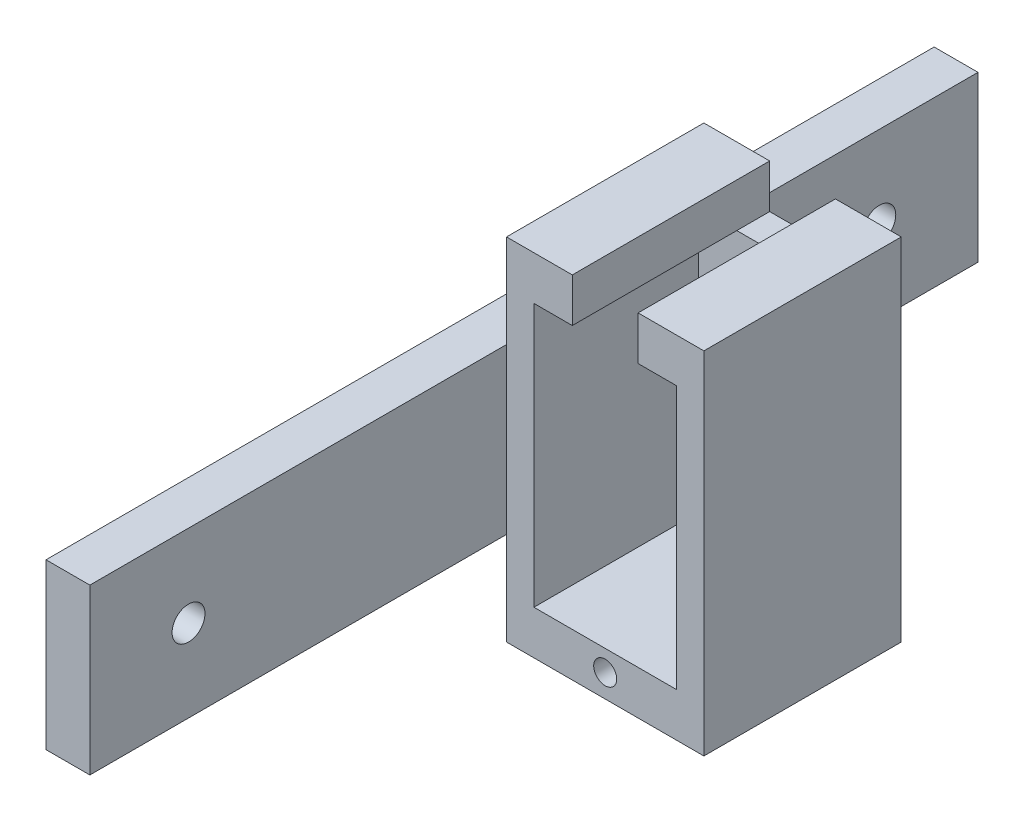
ISO-10303-21;
HEADER;
FILE_DESCRIPTION(('STEP AP214'),'2;1');
FILE_NAME('part.step','',(''),(''),'','','');
FILE_SCHEMA(('AUTOMOTIVE_DESIGN { 1 0 10303 214 1 1 1 1 }'));
ENDSEC;
DATA;
#1=APPLICATION_CONTEXT('core data for automotive mechanical design processes');
#2=APPLICATION_PROTOCOL_DEFINITION('international standard','automotive_design',2000,#1);
#3=PRODUCT_CONTEXT('',#1,'mechanical');
#4=PRODUCT('Part','Part','',(#3));
#5=PRODUCT_RELATED_PRODUCT_CATEGORY('part','',(#4));
#6=PRODUCT_DEFINITION_FORMATION('','',#4);
#7=PRODUCT_DEFINITION_CONTEXT('part definition',#1,'design');
#8=PRODUCT_DEFINITION('design','',#6,#7);
#9=PRODUCT_DEFINITION_SHAPE('','',#8);
#10=(LENGTH_UNIT() NAMED_UNIT(*) SI_UNIT(.MILLI.,.METRE.));
#11=(NAMED_UNIT(*) PLANE_ANGLE_UNIT() SI_UNIT($,.RADIAN.));
#12=(NAMED_UNIT(*) SI_UNIT($,.STERADIAN.) SOLID_ANGLE_UNIT());
#13=UNCERTAINTY_MEASURE_WITH_UNIT(LENGTH_MEASURE(1.E-05),#10,'distance_accuracy_value','');
#14=(GEOMETRIC_REPRESENTATION_CONTEXT(3) GLOBAL_UNCERTAINTY_ASSIGNED_CONTEXT((#13)) GLOBAL_UNIT_ASSIGNED_CONTEXT((#10,
#11,#12)) REPRESENTATION_CONTEXT('',''));
#15=CARTESIAN_POINT('',(0.,0.,0.));
#16=DIRECTION('',(0.,0.,1.));
#17=DIRECTION('',(1.,0.,0.));
#18=AXIS2_PLACEMENT_3D('',#15,#16,#17);
#19=CARTESIAN_POINT('',(-18.,0.,3.));
#20=DIRECTION('',(1.,0.,0.));
#21=DIRECTION('',(0.,1.,0.));
#22=AXIS2_PLACEMENT_3D('',#19,#20,#21);
#23=PLANE('',#22);
#24=DIRECTION('',(0.,0.,-1.));
#25=VECTOR('',#24,1.);
#26=CARTESIAN_POINT('',(-18.,23.5,-25.));
#27=LINE('',#26,#25);
#28=CARTESIAN_POINT('',(-18.,23.5,18.));
#29=VERTEX_POINT('',#28);
#30=CARTESIAN_POINT('',(-18.,23.5,0.));
#31=VERTEX_POINT('',#30);
#32=EDGE_CURVE('E11',#29,#31,#27,.T.);
#33=ORIENTED_EDGE('',*,*,#32,.F.);
#34=DIRECTION('',(0.,-1.,0.));
#35=VECTOR('',#34,1.);
#36=CARTESIAN_POINT('',(-18.,0.,18.));
#37=LINE('',#36,#35);
#38=CARTESIAN_POINT('',(-18.,32.,18.));
#39=VERTEX_POINT('',#38);
#40=EDGE_CURVE('E222',#39,#29,#37,.T.);
#41=ORIENTED_EDGE('',*,*,#40,.F.);
#42=DIRECTION('',(0.,0.,-1.));
#43=VECTOR('',#42,1.);
#44=CARTESIAN_POINT('',(-18.,32.,3.));
#45=LINE('',#44,#43);
#46=CARTESIAN_POINT('',(-18.,32.,0.));
#47=VERTEX_POINT('',#46);
#48=EDGE_CURVE('E307',#39,#47,#45,.T.);
#49=ORIENTED_EDGE('',*,*,#48,.T.);
#50=DIRECTION('',(0.,-1.,0.));
#51=VECTOR('',#50,1.);
#52=CARTESIAN_POINT('',(-18.,0.,0.));
#53=LINE('',#52,#51);
#54=EDGE_CURVE('E298',#47,#31,#53,.T.);
#55=ORIENTED_EDGE('',*,*,#54,.T.);
#56=EDGE_LOOP('',(#33,#41,#49,#55));
#57=FACE_BOUND('',#56,.T.);
#58=ADVANCED_FACE('F45',(#57),#23,.F.);
#59=DIRECTION('',(0.,0.,1.));
#60=VECTOR('',#59,1.);
#61=CARTESIAN_POINT('',(-18.,8.5,-25.));
#62=LINE('',#61,#60);
#63=CARTESIAN_POINT('',(-18.,8.5,0.));
#64=VERTEX_POINT('',#63);
#65=CARTESIAN_POINT('',(-18.,8.5,18.));
#66=VERTEX_POINT('',#65);
#67=EDGE_CURVE('E54',#64,#66,#62,.T.);
#68=ORIENTED_EDGE('',*,*,#67,.F.);
#69=CARTESIAN_POINT('',(-18.,0.,0.));
#70=VERTEX_POINT('',#69);
#71=EDGE_CURVE('E297',#64,#70,#53,.T.);
#72=ORIENTED_EDGE('',*,*,#71,.T.);
#73=DIRECTION('',(0.,0.,-1.));
#74=VECTOR('',#73,1.);
#75=CARTESIAN_POINT('',(-18.,0.,3.));
#76=LINE('',#75,#74);
#77=CARTESIAN_POINT('',(-18.,0.,18.));
#78=VERTEX_POINT('',#77);
#79=EDGE_CURVE('E304',#78,#70,#76,.T.);
#80=ORIENTED_EDGE('',*,*,#79,.F.);
#81=EDGE_CURVE('E220',#66,#78,#37,.T.);
#82=ORIENTED_EDGE('',*,*,#81,.F.);
#83=EDGE_LOOP('',(#68,#72,#80,#82));
#84=FACE_BOUND('',#83,.T.);
#85=ADVANCED_FACE('F374',(#84),#23,.F.);
#86=CARTESIAN_POINT('',(0.,0.,3.));
#87=DIRECTION('',(0.,0.,-1.));
#88=DIRECTION('',(-1.,0.,0.));
#89=AXIS2_PLACEMENT_3D('',#86,#87,#88);
#90=PLANE('',#89);
#91=DIRECTION('',(1.,0.,0.));
#92=VECTOR('',#91,1.);
#93=CARTESIAN_POINT('',(-15.5,28.,3.));
#94=LINE('',#93,#92);
#95=CARTESIAN_POINT('',(-15.5,28.,3.));
#96=VERTEX_POINT('',#95);
#97=CARTESIAN_POINT('',(-12.,28.,3.));
#98=VERTEX_POINT('',#97);
#99=EDGE_CURVE('E221',#96,#98,#94,.T.);
#100=ORIENTED_EDGE('',*,*,#99,.F.);
#101=DIRECTION('',(0.,1.,0.));
#102=VECTOR('',#101,1.);
#103=CARTESIAN_POINT('',(-15.5,4.,3.));
#104=LINE('',#103,#102);
#105=CARTESIAN_POINT('',(-15.5,4.,3.));
#106=VERTEX_POINT('',#105);
#107=EDGE_CURVE('E258',#106,#96,#104,.T.);
#108=ORIENTED_EDGE('',*,*,#107,.F.);
#109=DIRECTION('',(-1.,0.,0.));
#110=VECTOR('',#109,1.);
#111=CARTESIAN_POINT('',(-2.5,4.,3.));
#112=LINE('',#111,#110);
#113=CARTESIAN_POINT('',(-2.5,4.,3.));
#114=VERTEX_POINT('',#113);
#115=EDGE_CURVE('E255',#114,#106,#112,.T.);
#116=ORIENTED_EDGE('',*,*,#115,.F.);
#117=DIRECTION('',(0.,-1.,0.));
#118=VECTOR('',#117,1.);
#119=CARTESIAN_POINT('',(-2.5,28.,3.));
#120=LINE('',#119,#118);
#121=CARTESIAN_POINT('',(-2.5,28.,3.));
#122=VERTEX_POINT('',#121);
#123=EDGE_CURVE('E252',#122,#114,#120,.T.);
#124=ORIENTED_EDGE('',*,*,#123,.F.);
#125=DIRECTION('',(1.,0.,0.));
#126=VECTOR('',#125,1.);
#127=CARTESIAN_POINT('',(-6.,28.,3.));
#128=LINE('',#127,#126);
#129=CARTESIAN_POINT('',(-6.,28.,3.));
#130=VERTEX_POINT('',#129);
#131=EDGE_CURVE('E215',#130,#122,#128,.T.);
#132=ORIENTED_EDGE('',*,*,#131,.F.);
#133=DIRECTION('',(-1.,0.,0.));
#134=VECTOR('',#133,1.);
#135=CARTESIAN_POINT('',(-12.,28.,3.));
#136=LINE('',#135,#134);
#137=EDGE_CURVE('E281',#130,#98,#136,.T.);
#138=ORIENTED_EDGE('',*,*,#137,.T.);
#139=EDGE_LOOP('',(#100,#108,#116,#124,#132,#138));
#140=FACE_BOUND('',#139,.T.);
#141=ADVANCED_FACE('F380',(#140),#90,.F.);
#142=CARTESIAN_POINT('',(0.,0.,3.));
#143=DIRECTION('',(-1.,0.,0.));
#144=DIRECTION('',(0.,0.,1.));
#145=AXIS2_PLACEMENT_3D('',#142,#143,#144);
#146=PLANE('',#145);
#147=DIRECTION('',(0.,1.,0.));
#148=VECTOR('',#147,1.);
#149=CARTESIAN_POINT('',(0.,0.,0.));
#150=LINE('',#149,#148);
#151=CARTESIAN_POINT('',(0.,0.,0.));
#152=VERTEX_POINT('',#151);
#153=CARTESIAN_POINT('',(0.,32.,0.));
#154=VERTEX_POINT('',#153);
#155=EDGE_CURVE('E280',#152,#154,#150,.T.);
#156=ORIENTED_EDGE('',*,*,#155,.T.);
#157=DIRECTION('',(0.,0.,-1.));
#158=VECTOR('',#157,1.);
#159=CARTESIAN_POINT('',(0.,32.,3.));
#160=LINE('',#159,#158);
#161=CARTESIAN_POINT('',(0.,32.,18.));
#162=VERTEX_POINT('',#161);
#163=EDGE_CURVE('E49',#162,#154,#160,.T.);
#164=ORIENTED_EDGE('',*,*,#163,.F.);
#165=DIRECTION('',(0.,1.,0.));
#166=VECTOR('',#165,1.);
#167=CARTESIAN_POINT('',(0.,32.,18.));
#168=LINE('',#167,#166);
#169=CARTESIAN_POINT('',(0.,0.,18.));
#170=VERTEX_POINT('',#169);
#171=EDGE_CURVE('E228',#170,#162,#168,.T.);
#172=ORIENTED_EDGE('',*,*,#171,.F.);
#173=DIRECTION('',(0.,0.,-1.));
#174=VECTOR('',#173,1.);
#175=CARTESIAN_POINT('',(0.,0.,3.));
#176=LINE('',#175,#174);
#177=EDGE_CURVE('E283',#170,#152,#176,.T.);
#178=ORIENTED_EDGE('',*,*,#177,.T.);
#179=EDGE_LOOP('',(#156,#164,#172,#178));
#180=FACE_BOUND('',#179,.T.);
#181=ADVANCED_FACE('F47',(#180),#146,.F.);
#182=CARTESIAN_POINT('',(-6.,32.,3.));
#183=DIRECTION('',(0.,-1.,0.));
#184=DIRECTION('',(1.,0.,0.));
#185=AXIS2_PLACEMENT_3D('',#182,#183,#184);
#186=PLANE('',#185);
#187=DIRECTION('',(-1.,0.,0.));
#188=VECTOR('',#187,1.);
#189=CARTESIAN_POINT('',(-6.,32.,0.));
#190=LINE('',#189,#188);
#191=CARTESIAN_POINT('',(-6.,32.,0.));
#192=VERTEX_POINT('',#191);
#193=EDGE_CURVE('E287',#154,#192,#190,.T.);
#194=ORIENTED_EDGE('',*,*,#193,.T.);
#195=DIRECTION('',(0.,0.,-1.));
#196=VECTOR('',#195,1.);
#197=CARTESIAN_POINT('',(-6.,32.,3.));
#198=LINE('',#197,#196);
#199=CARTESIAN_POINT('',(-6.,32.,18.));
#200=VERTEX_POINT('',#199);
#201=EDGE_CURVE('E318',#200,#192,#198,.T.);
#202=ORIENTED_EDGE('',*,*,#201,.F.);
#203=DIRECTION('',(-1.,0.,0.));
#204=VECTOR('',#203,1.);
#205=CARTESIAN_POINT('',(-6.,32.,18.));
#206=LINE('',#205,#204);
#207=EDGE_CURVE('E231',#162,#200,#206,.T.);
#208=ORIENTED_EDGE('',*,*,#207,.F.);
#209=ORIENTED_EDGE('',*,*,#163,.T.);
#210=EDGE_LOOP('',(#194,#202,#208,#209));
#211=FACE_BOUND('',#210,.T.);
#212=ADVANCED_FACE('F399',(#211),#186,.F.);
#213=CARTESIAN_POINT('',(-6.,28.,3.));
#214=DIRECTION('',(1.,0.,0.));
#215=DIRECTION('',(0.,1.,0.));
#216=AXIS2_PLACEMENT_3D('',#213,#214,#215);
#217=PLANE('',#216);
#218=DIRECTION('',(0.,-1.,0.));
#219=VECTOR('',#218,1.);
#220=CARTESIAN_POINT('',(-6.,28.,0.));
#221=LINE('',#220,#219);
#222=CARTESIAN_POINT('',(-6.,28.,0.));
#223=VERTEX_POINT('',#222);
#224=EDGE_CURVE('E289',#192,#223,#221,.T.);
#225=ORIENTED_EDGE('',*,*,#224,.T.);
#226=DIRECTION('',(0.,0.,-1.));
#227=VECTOR('',#226,1.);
#228=CARTESIAN_POINT('',(-6.,28.,3.));
#229=LINE('',#228,#227);
#230=EDGE_CURVE('E316',#130,#223,#229,.T.);
#231=ORIENTED_EDGE('',*,*,#230,.F.);
#232=DIRECTION('',(0.,0.,-1.));
#233=VECTOR('',#232,1.);
#234=CARTESIAN_POINT('',(-6.,28.,18.));
#235=LINE('',#234,#233);
#236=CARTESIAN_POINT('',(-6.,28.,18.));
#237=VERTEX_POINT('',#236);
#238=EDGE_CURVE('E277',#237,#130,#235,.T.);
#239=ORIENTED_EDGE('',*,*,#238,.F.);
#240=DIRECTION('',(0.,-1.,0.));
#241=VECTOR('',#240,1.);
#242=CARTESIAN_POINT('',(-6.,28.,18.));
#243=LINE('',#242,#241);
#244=EDGE_CURVE('E234',#200,#237,#243,.T.);
#245=ORIENTED_EDGE('',*,*,#244,.F.);
#246=ORIENTED_EDGE('',*,*,#201,.T.);
#247=EDGE_LOOP('',(#225,#231,#239,#245,#246));
#248=FACE_BOUND('',#247,.T.);
#249=ADVANCED_FACE('F396',(#248),#217,.F.);
#250=CARTESIAN_POINT('',(-12.,28.,3.));
#251=DIRECTION('',(0.,-1.,0.));
#252=DIRECTION('',(0.,0.,-1.));
#253=AXIS2_PLACEMENT_3D('',#250,#251,#252);
#254=PLANE('',#253);
#255=DIRECTION('',(-1.,0.,0.));
#256=VECTOR('',#255,1.);
#257=CARTESIAN_POINT('',(-12.,28.,0.));
#258=LINE('',#257,#256);
#259=CARTESIAN_POINT('',(-12.,28.,0.));
#260=VERTEX_POINT('',#259);
#261=EDGE_CURVE('E291',#223,#260,#258,.T.);
#262=ORIENTED_EDGE('',*,*,#261,.T.);
#263=DIRECTION('',(0.,0.,-1.));
#264=VECTOR('',#263,1.);
#265=CARTESIAN_POINT('',(-12.,28.,3.));
#266=LINE('',#265,#264);
#267=EDGE_CURVE('E313',#98,#260,#266,.T.);
#268=ORIENTED_EDGE('',*,*,#267,.F.);
#269=ORIENTED_EDGE('',*,*,#137,.F.);
#270=ORIENTED_EDGE('',*,*,#230,.T.);
#271=EDGE_LOOP('',(#262,#268,#269,#270));
#272=FACE_BOUND('',#271,.T.);
#273=ADVANCED_FACE('F392',(#272),#254,.F.);
#274=CARTESIAN_POINT('',(-12.,32.,3.));
#275=DIRECTION('',(-1.,0.,0.));
#276=DIRECTION('',(0.,0.,1.));
#277=AXIS2_PLACEMENT_3D('',#274,#275,#276);
#278=PLANE('',#277);
#279=DIRECTION('',(0.,1.,0.));
#280=VECTOR('',#279,1.);
#281=CARTESIAN_POINT('',(-12.,32.,0.));
#282=LINE('',#281,#280);
#283=CARTESIAN_POINT('',(-12.,32.,0.));
#284=VERTEX_POINT('',#283);
#285=EDGE_CURVE('E293',#260,#284,#282,.T.);
#286=ORIENTED_EDGE('',*,*,#285,.T.);
#287=DIRECTION('',(0.,0.,-1.));
#288=VECTOR('',#287,1.);
#289=CARTESIAN_POINT('',(-12.,32.,3.));
#290=LINE('',#289,#288);
#291=CARTESIAN_POINT('',(-12.,32.,18.));
#292=VERTEX_POINT('',#291);
#293=EDGE_CURVE('E310',#292,#284,#290,.T.);
#294=ORIENTED_EDGE('',*,*,#293,.F.);
#295=DIRECTION('',(0.,1.,0.));
#296=VECTOR('',#295,1.);
#297=CARTESIAN_POINT('',(-12.,32.,18.));
#298=LINE('',#297,#296);
#299=CARTESIAN_POINT('',(-12.,28.,18.));
#300=VERTEX_POINT('',#299);
#301=EDGE_CURVE('E246',#300,#292,#298,.T.);
#302=ORIENTED_EDGE('',*,*,#301,.F.);
#303=DIRECTION('',(0.,0.,-1.));
#304=VECTOR('',#303,1.);
#305=CARTESIAN_POINT('',(-12.,28.,18.));
#306=LINE('',#305,#304);
#307=EDGE_CURVE('E249',#300,#98,#306,.T.);
#308=ORIENTED_EDGE('',*,*,#307,.T.);
#309=ORIENTED_EDGE('',*,*,#267,.T.);
#310=EDGE_LOOP('',(#286,#294,#302,#308,#309));
#311=FACE_BOUND('',#310,.T.);
#312=ADVANCED_FACE('F388',(#311),#278,.F.);
#313=CARTESIAN_POINT('',(-12.,32.,3.));
#314=DIRECTION('',(0.,-1.,0.));
#315=DIRECTION('',(0.,0.,-1.));
#316=AXIS2_PLACEMENT_3D('',#313,#314,#315);
#317=PLANE('',#316);
#318=DIRECTION('',(-1.,0.,0.));
#319=VECTOR('',#318,1.);
#320=CARTESIAN_POINT('',(-12.,32.,0.));
#321=LINE('',#320,#319);
#322=EDGE_CURVE('E295',#284,#47,#321,.T.);
#323=ORIENTED_EDGE('',*,*,#322,.T.);
#324=ORIENTED_EDGE('',*,*,#48,.F.);
#325=DIRECTION('',(-1.,0.,0.));
#326=VECTOR('',#325,1.);
#327=CARTESIAN_POINT('',(-18.,32.,18.));
#328=LINE('',#327,#326);
#329=EDGE_CURVE('E217',#292,#39,#328,.T.);
#330=ORIENTED_EDGE('',*,*,#329,.F.);
#331=ORIENTED_EDGE('',*,*,#293,.T.);
#332=EDGE_LOOP('',(#323,#324,#330,#331));
#333=FACE_BOUND('',#332,.T.);
#334=ADVANCED_FACE('F385',(#333),#317,.F.);
#335=CARTESIAN_POINT('',(0.,0.,3.));
#336=DIRECTION('',(0.,1.,0.));
#337=DIRECTION('',(-1.,0.,0.));
#338=AXIS2_PLACEMENT_3D('',#335,#336,#337);
#339=PLANE('',#338);
#340=DIRECTION('',(1.,0.,0.));
#341=VECTOR('',#340,1.);
#342=CARTESIAN_POINT('',(0.,0.,0.));
#343=LINE('',#342,#341);
#344=EDGE_CURVE('E284',#70,#152,#343,.T.);
#345=ORIENTED_EDGE('',*,*,#344,.T.);
#346=ORIENTED_EDGE('',*,*,#177,.F.);
#347=DIRECTION('',(1.,0.,0.));
#348=VECTOR('',#347,1.);
#349=CARTESIAN_POINT('',(-18.,0.,18.));
#350=LINE('',#349,#348);
#351=EDGE_CURVE('E224',#78,#170,#350,.T.);
#352=ORIENTED_EDGE('',*,*,#351,.F.);
#353=ORIENTED_EDGE('',*,*,#79,.T.);
#354=EDGE_LOOP('',(#345,#346,#352,#353));
#355=FACE_BOUND('',#354,.T.);
#356=ADVANCED_FACE('F383',(#355),#339,.F.);
#357=CARTESIAN_POINT('',(0.,0.,0.));
#358=DIRECTION('',(0.,0.,-1.));
#359=DIRECTION('',(-1.,0.,0.));
#360=AXIS2_PLACEMENT_3D('',#357,#358,#359);
#361=PLANE('',#360);
#362=ORIENTED_EDGE('',*,*,#155,.F.);
#363=ORIENTED_EDGE('',*,*,#344,.F.);
#364=ORIENTED_EDGE('',*,*,#71,.F.);
#365=EDGE_CURVE('E300',#31,#64,#53,.T.);
#366=ORIENTED_EDGE('',*,*,#365,.F.);
#367=ORIENTED_EDGE('',*,*,#54,.F.);
#368=ORIENTED_EDGE('',*,*,#322,.F.);
#369=ORIENTED_EDGE('',*,*,#285,.F.);
#370=ORIENTED_EDGE('',*,*,#261,.F.);
#371=ORIENTED_EDGE('',*,*,#224,.F.);
#372=ORIENTED_EDGE('',*,*,#193,.F.);
#373=EDGE_LOOP('',(#362,#363,#364,#366,#367,#368,#369,#370,#371,#372));
#374=FACE_BOUND('',#373,.T.);
#375=ADVANCED_FACE('F407',(#374),#361,.T.);
#376=CARTESIAN_POINT('',(-6.,28.,18.));
#377=DIRECTION('',(0.,1.,0.));
#378=DIRECTION('',(0.,0.,1.));
#379=AXIS2_PLACEMENT_3D('',#376,#377,#378);
#380=PLANE('',#379);
#381=ORIENTED_EDGE('',*,*,#131,.T.);
#382=DIRECTION('',(0.,0.,-1.));
#383=VECTOR('',#382,1.);
#384=CARTESIAN_POINT('',(-2.5,28.,18.));
#385=LINE('',#384,#383);
#386=CARTESIAN_POINT('',(-2.5,28.,18.));
#387=VERTEX_POINT('',#386);
#388=EDGE_CURVE('E274',#387,#122,#385,.T.);
#389=ORIENTED_EDGE('',*,*,#388,.F.);
#390=DIRECTION('',(1.,0.,0.));
#391=VECTOR('',#390,1.);
#392=CARTESIAN_POINT('',(-6.,28.,18.));
#393=LINE('',#392,#391);
#394=EDGE_CURVE('E236',#237,#387,#393,.T.);
#395=ORIENTED_EDGE('',*,*,#394,.F.);
#396=ORIENTED_EDGE('',*,*,#238,.T.);
#397=EDGE_LOOP('',(#381,#389,#395,#396));
#398=FACE_BOUND('',#397,.T.);
#399=ADVANCED_FACE('F418',(#398),#380,.F.);
#400=CARTESIAN_POINT('',(-2.5,28.,18.));
#401=DIRECTION('',(1.,0.,0.));
#402=DIRECTION('',(0.,1.,0.));
#403=AXIS2_PLACEMENT_3D('',#400,#401,#402);
#404=PLANE('',#403);
#405=ORIENTED_EDGE('',*,*,#123,.T.);
#406=DIRECTION('',(0.,0.,-1.));
#407=VECTOR('',#406,1.);
#408=CARTESIAN_POINT('',(-2.5,4.,18.));
#409=LINE('',#408,#407);
#410=CARTESIAN_POINT('',(-2.5,4.,18.));
#411=VERTEX_POINT('',#410);
#412=EDGE_CURVE('E271',#411,#114,#409,.T.);
#413=ORIENTED_EDGE('',*,*,#412,.F.);
#414=DIRECTION('',(0.,-1.,0.));
#415=VECTOR('',#414,1.);
#416=CARTESIAN_POINT('',(-2.5,28.,18.));
#417=LINE('',#416,#415);
#418=EDGE_CURVE('E238',#387,#411,#417,.T.);
#419=ORIENTED_EDGE('',*,*,#418,.F.);
#420=ORIENTED_EDGE('',*,*,#388,.T.);
#421=EDGE_LOOP('',(#405,#413,#419,#420));
#422=FACE_BOUND('',#421,.T.);
#423=ADVANCED_FACE('F458',(#422),#404,.F.);
#424=CARTESIAN_POINT('',(-2.5,4.,18.));
#425=DIRECTION('',(0.,-1.,0.));
#426=DIRECTION('',(1.,0.,0.));
#427=AXIS2_PLACEMENT_3D('',#424,#425,#426);
#428=PLANE('',#427);
#429=ORIENTED_EDGE('',*,*,#115,.T.);
#430=DIRECTION('',(0.,0.,-1.));
#431=VECTOR('',#430,1.);
#432=CARTESIAN_POINT('',(-15.5,4.,18.));
#433=LINE('',#432,#431);
#434=CARTESIAN_POINT('',(-15.5,4.,18.));
#435=VERTEX_POINT('',#434);
#436=EDGE_CURVE('E268',#435,#106,#433,.T.);
#437=ORIENTED_EDGE('',*,*,#436,.F.);
#438=DIRECTION('',(-1.,0.,0.));
#439=VECTOR('',#438,1.);
#440=CARTESIAN_POINT('',(-2.5,4.,18.));
#441=LINE('',#440,#439);
#442=EDGE_CURVE('E240',#411,#435,#441,.T.);
#443=ORIENTED_EDGE('',*,*,#442,.F.);
#444=ORIENTED_EDGE('',*,*,#412,.T.);
#445=EDGE_LOOP('',(#429,#437,#443,#444));
#446=FACE_BOUND('',#445,.T.);
#447=ADVANCED_FACE('F455',(#446),#428,.F.);
#448=CARTESIAN_POINT('',(-15.5,4.,18.));
#449=DIRECTION('',(-1.,0.,0.));
#450=DIRECTION('',(0.,-1.,0.));
#451=AXIS2_PLACEMENT_3D('',#448,#449,#450);
#452=PLANE('',#451);
#453=ORIENTED_EDGE('',*,*,#107,.T.);
#454=DIRECTION('',(0.,0.,-1.));
#455=VECTOR('',#454,1.);
#456=CARTESIAN_POINT('',(-15.5,28.,18.));
#457=LINE('',#456,#455);
#458=CARTESIAN_POINT('',(-15.5,28.,18.));
#459=VERTEX_POINT('',#458);
#460=EDGE_CURVE('E265',#459,#96,#457,.T.);
#461=ORIENTED_EDGE('',*,*,#460,.F.);
#462=DIRECTION('',(0.,1.,0.));
#463=VECTOR('',#462,1.);
#464=CARTESIAN_POINT('',(-15.5,4.,18.));
#465=LINE('',#464,#463);
#466=EDGE_CURVE('E242',#435,#459,#465,.T.);
#467=ORIENTED_EDGE('',*,*,#466,.F.);
#468=ORIENTED_EDGE('',*,*,#436,.T.);
#469=EDGE_LOOP('',(#453,#461,#467,#468));
#470=FACE_BOUND('',#469,.T.);
#471=ADVANCED_FACE('F451',(#470),#452,.F.);
#472=CARTESIAN_POINT('',(-15.5,28.,18.));
#473=DIRECTION('',(0.,1.,0.));
#474=DIRECTION('',(0.,0.,1.));
#475=AXIS2_PLACEMENT_3D('',#472,#473,#474);
#476=PLANE('',#475);
#477=ORIENTED_EDGE('',*,*,#99,.T.);
#478=ORIENTED_EDGE('',*,*,#307,.F.);
#479=DIRECTION('',(1.,0.,0.));
#480=VECTOR('',#479,1.);
#481=CARTESIAN_POINT('',(-15.5,28.,18.));
#482=LINE('',#481,#480);
#483=EDGE_CURVE('E244',#459,#300,#482,.T.);
#484=ORIENTED_EDGE('',*,*,#483,.F.);
#485=ORIENTED_EDGE('',*,*,#460,.T.);
#486=EDGE_LOOP('',(#477,#478,#484,#485));
#487=FACE_BOUND('',#486,.T.);
#488=ADVANCED_FACE('F449',(#487),#476,.F.);
#489=CARTESIAN_POINT('',(0.,0.,18.));
#490=DIRECTION('',(0.,0.,-1.));
#491=DIRECTION('',(-1.,0.,0.));
#492=AXIS2_PLACEMENT_3D('',#489,#490,#491);
#493=PLANE('',#492);
#494=CARTESIAN_POINT('',(-9.,2.1,18.));
#495=DIRECTION('',(0.,0.,1.));
#496=DIRECTION('',(1.,0.,0.));
#497=AXIS2_PLACEMENT_3D('',#494,#495,#496);
#498=CIRCLE('',#497,1.05);
#499=CARTESIAN_POINT('',(-7.95,2.1,18.));
#500=VERTEX_POINT('',#499);
#501=EDGE_CURVE('E205',#500,#500,#498,.T.);
#502=ORIENTED_EDGE('',*,*,#501,.F.);
#503=EDGE_LOOP('',(#502));
#504=FACE_BOUND('',#503,.T.);
#505=ORIENTED_EDGE('',*,*,#329,.T.);
#506=ORIENTED_EDGE('',*,*,#40,.T.);
#507=EDGE_CURVE('E225',#29,#66,#37,.T.);
#508=ORIENTED_EDGE('',*,*,#507,.T.);
#509=ORIENTED_EDGE('',*,*,#81,.T.);
#510=ORIENTED_EDGE('',*,*,#351,.T.);
#511=ORIENTED_EDGE('',*,*,#171,.T.);
#512=ORIENTED_EDGE('',*,*,#207,.T.);
#513=ORIENTED_EDGE('',*,*,#244,.T.);
#514=ORIENTED_EDGE('',*,*,#394,.T.);
#515=ORIENTED_EDGE('',*,*,#418,.T.);
#516=ORIENTED_EDGE('',*,*,#442,.T.);
#517=ORIENTED_EDGE('',*,*,#466,.T.);
#518=ORIENTED_EDGE('',*,*,#483,.T.);
#519=ORIENTED_EDGE('',*,*,#301,.T.);
#520=EDGE_LOOP('',(#505,#506,#508,#509,#510,#511,#512,#513,#514,#515,#516,#517,#518,#519));
#521=FACE_BOUND('',#520,.T.);
#522=ADVANCED_FACE('F421',(#504,#521),#493,.F.);
#523=CARTESIAN_POINT('',(-9.,2.1,12.));
#524=DIRECTION('',(0.,0.,1.));
#525=DIRECTION('',(1.,0.,0.));
#526=AXIS2_PLACEMENT_3D('',#523,#524,#525);
#527=CYLINDRICAL_SURFACE('',#526,1.05);
#528=CARTESIAN_POINT('',(-9.,2.1,12.));
#529=DIRECTION('',(0.,0.,1.));
#530=DIRECTION('',(1.,0.,0.));
#531=AXIS2_PLACEMENT_3D('',#528,#529,#530);
#532=CIRCLE('',#531,1.05);
#533=CARTESIAN_POINT('',(-7.95,2.1,12.));
#534=VERTEX_POINT('',#533);
#535=EDGE_CURVE('E208',#534,#534,#532,.T.);
#536=ORIENTED_EDGE('',*,*,#535,.F.);
#537=EDGE_LOOP('',(#536));
#538=FACE_BOUND('',#537,.T.);
#539=ORIENTED_EDGE('',*,*,#501,.T.);
#540=EDGE_LOOP('',(#539));
#541=FACE_BOUND('',#540,.T.);
#542=ADVANCED_FACE('F521',(#538,#541),#527,.F.);
#543=CARTESIAN_POINT('',(-9.,2.1,12.));
#544=DIRECTION('',(0.,0.,1.));
#545=DIRECTION('',(1.,0.,0.));
#546=AXIS2_PLACEMENT_3D('',#543,#544,#545);
#547=PLANE('',#546);
#548=ORIENTED_EDGE('',*,*,#535,.T.);
#549=EDGE_LOOP('',(#548));
#550=FACE_BOUND('',#549,.T.);
#551=ADVANCED_FACE('F531',(#550),#547,.T.);
#552=CARTESIAN_POINT('',(-18.,0.,0.));
#553=DIRECTION('',(-1.,0.,0.));
#554=DIRECTION('',(0.,-1.,0.));
#555=AXIS2_PLACEMENT_3D('',#552,#553,#554);
#556=PLANE('',#555);
#557=CARTESIAN_POINT('',(-18.,16.,-16.));
#558=DIRECTION('',(-1.,0.,0.));
#559=DIRECTION('',(0.,-1.,0.));
#560=AXIS2_PLACEMENT_3D('',#557,#558,#559);
#561=CIRCLE('',#560,1.5);
#562=CARTESIAN_POINT('',(-18.,14.5,-16.));
#563=VERTEX_POINT('',#562);
#564=EDGE_CURVE('E333',#563,#563,#561,.T.);
#565=ORIENTED_EDGE('',*,*,#564,.T.);
#566=EDGE_LOOP('',(#565));
#567=FACE_BOUND('',#566,.T.);
#568=CARTESIAN_POINT('',(-18.,23.5,-25.));
#569=VERTEX_POINT('',#568);
#570=EDGE_CURVE('E57',#31,#569,#27,.T.);
#571=ORIENTED_EDGE('',*,*,#570,.F.);
#572=ORIENTED_EDGE('',*,*,#365,.T.);
#573=CARTESIAN_POINT('',(-18.,8.5,-25.));
#574=VERTEX_POINT('',#573);
#575=EDGE_CURVE('E327',#574,#64,#62,.T.);
#576=ORIENTED_EDGE('',*,*,#575,.F.);
#577=DIRECTION('',(0.,-1.,0.));
#578=VECTOR('',#577,1.);
#579=CARTESIAN_POINT('',(-18.,23.5,-25.));
#580=LINE('',#579,#578);
#581=EDGE_CURVE('E204',#569,#574,#580,.T.);
#582=ORIENTED_EDGE('',*,*,#581,.F.);
#583=EDGE_LOOP('',(#571,#572,#576,#582));
#584=FACE_BOUND('',#583,.T.);
#585=ADVANCED_FACE('F371',(#567,#584),#556,.F.);
#586=CARTESIAN_POINT('',(-22.,23.5,-25.));
#587=DIRECTION('',(0.,0.,1.));
#588=DIRECTION('',(1.,0.,0.));
#589=AXIS2_PLACEMENT_3D('',#586,#587,#588);
#590=PLANE('',#589);
#591=ORIENTED_EDGE('',*,*,#581,.T.);
#592=DIRECTION('',(1.,0.,0.));
#593=VECTOR('',#592,1.);
#594=CARTESIAN_POINT('',(-22.,8.5,-25.));
#595=LINE('',#594,#593);
#596=CARTESIAN_POINT('',(-22.,8.5,-25.));
#597=VERTEX_POINT('',#596);
#598=EDGE_CURVE('E185',#597,#574,#595,.T.);
#599=ORIENTED_EDGE('',*,*,#598,.F.);
#600=DIRECTION('',(0.,-1.,0.));
#601=VECTOR('',#600,1.);
#602=CARTESIAN_POINT('',(-22.,23.5,-25.));
#603=LINE('',#602,#601);
#604=CARTESIAN_POINT('',(-22.,23.5,-25.));
#605=VERTEX_POINT('',#604);
#606=EDGE_CURVE('E192',#605,#597,#603,.T.);
#607=ORIENTED_EDGE('',*,*,#606,.F.);
#608=DIRECTION('',(1.,0.,0.));
#609=VECTOR('',#608,1.);
#610=CARTESIAN_POINT('',(-22.,23.5,-25.));
#611=LINE('',#610,#609);
#612=EDGE_CURVE('E339',#605,#569,#611,.T.);
#613=ORIENTED_EDGE('',*,*,#612,.T.);
#614=EDGE_LOOP('',(#591,#599,#607,#613));
#615=FACE_BOUND('',#614,.T.);
#616=ADVANCED_FACE('F202',(#615),#590,.F.);
#617=CARTESIAN_POINT('',(-22.,8.5,-25.));
#618=DIRECTION('',(0.,1.,0.));
#619=DIRECTION('',(-1.,0.,0.));
#620=AXIS2_PLACEMENT_3D('',#617,#618,#619);
#621=PLANE('',#620);
#622=ORIENTED_EDGE('',*,*,#575,.T.);
#623=ORIENTED_EDGE('',*,*,#67,.T.);
#624=CARTESIAN_POINT('',(-18.,8.5,56.));
#625=VERTEX_POINT('',#624);
#626=EDGE_CURVE('E328',#66,#625,#62,.T.);
#627=ORIENTED_EDGE('',*,*,#626,.T.);
#628=DIRECTION('',(1.,0.,0.));
#629=VECTOR('',#628,1.);
#630=CARTESIAN_POINT('',(-22.,8.5,56.));
#631=LINE('',#630,#629);
#632=CARTESIAN_POINT('',(-22.,8.5,56.));
#633=VERTEX_POINT('',#632);
#634=EDGE_CURVE('E188',#633,#625,#631,.T.);
#635=ORIENTED_EDGE('',*,*,#634,.F.);
#636=DIRECTION('',(0.,0.,1.));
#637=VECTOR('',#636,1.);
#638=CARTESIAN_POINT('',(-22.,8.5,-25.));
#639=LINE('',#638,#637);
#640=EDGE_CURVE('E180',#597,#633,#639,.T.);
#641=ORIENTED_EDGE('',*,*,#640,.F.);
#642=ORIENTED_EDGE('',*,*,#598,.T.);
#643=EDGE_LOOP('',(#622,#623,#627,#635,#641,#642));
#644=FACE_BOUND('',#643,.T.);
#645=ADVANCED_FACE('F183',(#644),#621,.F.);
#646=CARTESIAN_POINT('',(-22.,23.5,56.));
#647=DIRECTION('',(0.,0.,-1.));
#648=DIRECTION('',(-1.,0.,0.));
#649=AXIS2_PLACEMENT_3D('',#646,#647,#648);
#650=PLANE('',#649);
#651=DIRECTION('',(0.,1.,0.));
#652=VECTOR('',#651,1.);
#653=CARTESIAN_POINT('',(-18.,23.5,56.));
#654=LINE('',#653,#652);
#655=CARTESIAN_POINT('',(-18.,23.5,56.));
#656=VERTEX_POINT('',#655);
#657=EDGE_CURVE('E331',#625,#656,#654,.T.);
#658=ORIENTED_EDGE('',*,*,#657,.T.);
#659=DIRECTION('',(1.,0.,0.));
#660=VECTOR('',#659,1.);
#661=CARTESIAN_POINT('',(-22.,23.5,56.));
#662=LINE('',#661,#660);
#663=CARTESIAN_POINT('',(-22.,23.5,56.));
#664=VERTEX_POINT('',#663);
#665=EDGE_CURVE('E210',#664,#656,#662,.T.);
#666=ORIENTED_EDGE('',*,*,#665,.F.);
#667=DIRECTION('',(0.,1.,0.));
#668=VECTOR('',#667,1.);
#669=CARTESIAN_POINT('',(-22.,23.5,56.));
#670=LINE('',#669,#668);
#671=EDGE_CURVE('E191',#633,#664,#670,.T.);
#672=ORIENTED_EDGE('',*,*,#671,.F.);
#673=ORIENTED_EDGE('',*,*,#634,.T.);
#674=EDGE_LOOP('',(#658,#666,#672,#673));
#675=FACE_BOUND('',#674,.T.);
#676=ADVANCED_FACE('F440',(#675),#650,.F.);
#677=CARTESIAN_POINT('',(-22.,23.5,-25.));
#678=DIRECTION('',(0.,-1.,0.));
#679=DIRECTION('',(1.,0.,0.));
#680=AXIS2_PLACEMENT_3D('',#677,#678,#679);
#681=PLANE('',#680);
#682=EDGE_CURVE('E56',#656,#29,#27,.T.);
#683=ORIENTED_EDGE('',*,*,#682,.T.);
#684=ORIENTED_EDGE('',*,*,#32,.T.);
#685=ORIENTED_EDGE('',*,*,#570,.T.);
#686=ORIENTED_EDGE('',*,*,#612,.F.);
#687=DIRECTION('',(0.,0.,-1.));
#688=VECTOR('',#687,1.);
#689=CARTESIAN_POINT('',(-22.,23.5,-25.));
#690=LINE('',#689,#688);
#691=EDGE_CURVE('E197',#664,#605,#690,.T.);
#692=ORIENTED_EDGE('',*,*,#691,.F.);
#693=ORIENTED_EDGE('',*,*,#665,.T.);
#694=EDGE_LOOP('',(#683,#684,#685,#686,#692,#693));
#695=FACE_BOUND('',#694,.T.);
#696=ADVANCED_FACE('F355',(#695),#681,.F.);
#697=CARTESIAN_POINT('',(-22.,0.,0.));
#698=DIRECTION('',(-1.,0.,0.));
#699=DIRECTION('',(0.,-1.,0.));
#700=AXIS2_PLACEMENT_3D('',#697,#698,#699);
#701=PLANE('',#700);
#702=CARTESIAN_POINT('',(-22.,16.,-16.));
#703=DIRECTION('',(-1.,0.,0.));
#704=DIRECTION('',(0.,-1.,0.));
#705=AXIS2_PLACEMENT_3D('',#702,#703,#704);
#706=CIRCLE('',#705,1.5);
#707=CARTESIAN_POINT('',(-22.,14.5,-16.));
#708=VERTEX_POINT('',#707);
#709=EDGE_CURVE('E335',#708,#708,#706,.T.);
#710=ORIENTED_EDGE('',*,*,#709,.F.);
#711=EDGE_LOOP('',(#710));
#712=FACE_BOUND('',#711,.T.);
#713=CARTESIAN_POINT('',(-22.,16.,47.));
#714=DIRECTION('',(-1.,0.,0.));
#715=DIRECTION('',(0.,-1.,0.));
#716=AXIS2_PLACEMENT_3D('',#713,#714,#715);
#717=CIRCLE('',#716,1.5);
#718=CARTESIAN_POINT('',(-22.,14.5,47.));
#719=VERTEX_POINT('',#718);
#720=EDGE_CURVE('E344',#719,#719,#717,.T.);
#721=ORIENTED_EDGE('',*,*,#720,.F.);
#722=EDGE_LOOP('',(#721));
#723=FACE_BOUND('',#722,.T.);
#724=ORIENTED_EDGE('',*,*,#606,.T.);
#725=ORIENTED_EDGE('',*,*,#640,.T.);
#726=ORIENTED_EDGE('',*,*,#671,.T.);
#727=ORIENTED_EDGE('',*,*,#691,.T.);
#728=EDGE_LOOP('',(#724,#725,#726,#727));
#729=FACE_BOUND('',#728,.T.);
#730=ADVANCED_FACE('F195',(#712,#723,#729),#701,.T.);
#731=CARTESIAN_POINT('',(-18.,16.,47.));
#732=DIRECTION('',(-1.,0.,0.));
#733=DIRECTION('',(0.,-1.,0.));
#734=AXIS2_PLACEMENT_3D('',#731,#732,#733);
#735=CIRCLE('',#734,1.5);
#736=CARTESIAN_POINT('',(-18.,14.5,47.));
#737=VERTEX_POINT('',#736);
#738=EDGE_CURVE('E341',#737,#737,#735,.T.);
#739=ORIENTED_EDGE('',*,*,#738,.T.);
#740=EDGE_LOOP('',(#739));
#741=FACE_BOUND('',#740,.T.);
#742=ORIENTED_EDGE('',*,*,#507,.F.);
#743=ORIENTED_EDGE('',*,*,#682,.F.);
#744=ORIENTED_EDGE('',*,*,#657,.F.);
#745=ORIENTED_EDGE('',*,*,#626,.F.);
#746=EDGE_LOOP('',(#742,#743,#744,#745));
#747=FACE_BOUND('',#746,.T.);
#748=ADVANCED_FACE('F354',(#741,#747),#556,.F.);
#749=CARTESIAN_POINT('',(-18.,16.,47.));
#750=DIRECTION('',(-1.,0.,0.));
#751=DIRECTION('',(0.,-1.,0.));
#752=AXIS2_PLACEMENT_3D('',#749,#750,#751);
#753=CYLINDRICAL_SURFACE('',#752,1.5);
#754=ORIENTED_EDGE('',*,*,#738,.F.);
#755=EDGE_LOOP('',(#754));
#756=FACE_BOUND('',#755,.T.);
#757=ORIENTED_EDGE('',*,*,#720,.T.);
#758=EDGE_LOOP('',(#757));
#759=FACE_BOUND('',#758,.T.);
#760=ADVANCED_FACE('F359',(#756,#759),#753,.F.);
#761=CARTESIAN_POINT('',(-18.,16.,-16.));
#762=DIRECTION('',(-1.,0.,0.));
#763=DIRECTION('',(0.,-1.,0.));
#764=AXIS2_PLACEMENT_3D('',#761,#762,#763);
#765=CYLINDRICAL_SURFACE('',#764,1.5);
#766=ORIENTED_EDGE('',*,*,#564,.F.);
#767=EDGE_LOOP('',(#766));
#768=FACE_BOUND('',#767,.T.);
#769=ORIENTED_EDGE('',*,*,#709,.T.);
#770=EDGE_LOOP('',(#769));
#771=FACE_BOUND('',#770,.T.);
#772=ADVANCED_FACE('F350',(#768,#771),#765,.F.);
#773=CLOSED_SHELL('',(#58,#85,#141,#181,#212,#249,#273,#312,#334,#356,#375,#399,#423,#447,#471,
#488,#522,#542,#551,#585,#616,#645,#676,#696,#730,#748,#760,#772));
#774=MANIFOLD_SOLID_BREP('B2',#773);
#775=ADVANCED_BREP_SHAPE_REPRESENTATION('',(#18,#774),#14);
#776=SHAPE_DEFINITION_REPRESENTATION(#9,#775);
ENDSEC;
END-ISO-10303-21;
